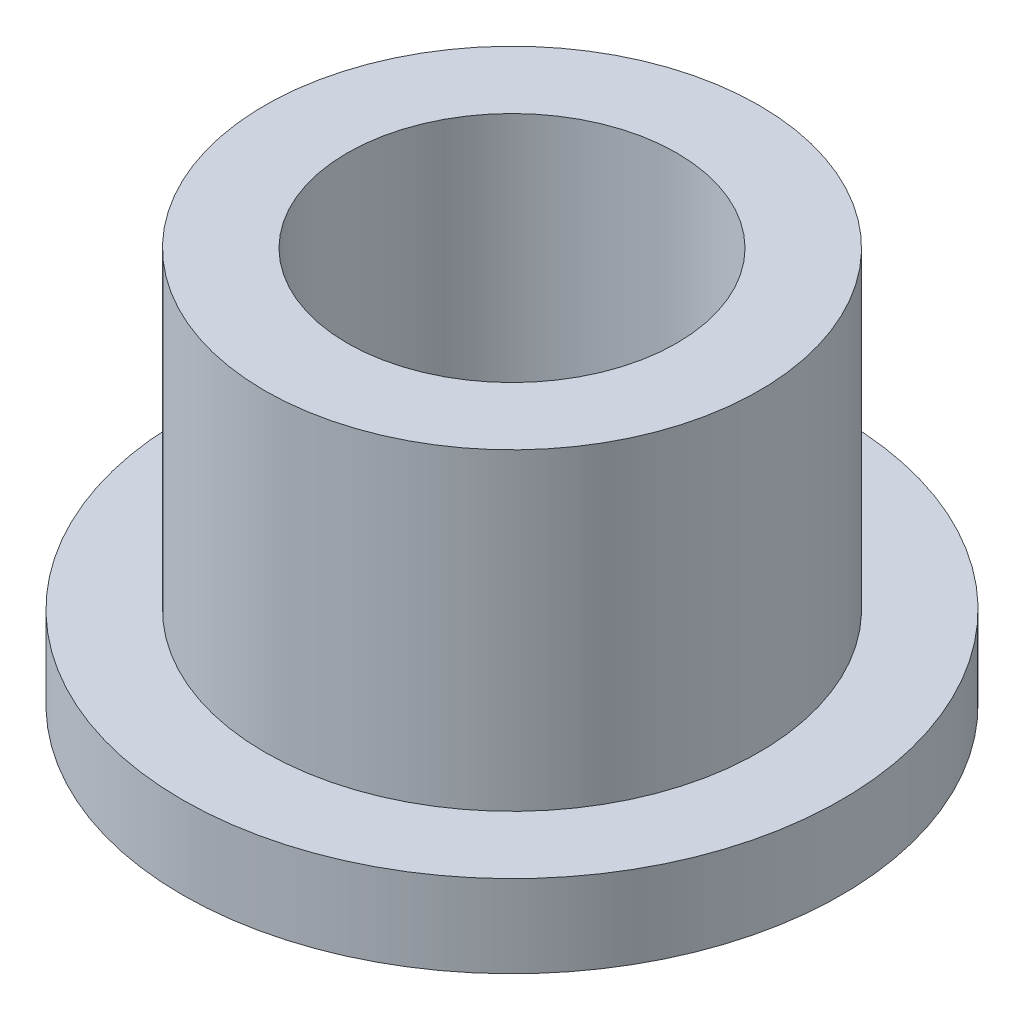
ISO-10303-21;
HEADER;
FILE_DESCRIPTION(('STEP AP214'),'2;1');
FILE_NAME('part.step','',(''),(''),'','','');
FILE_SCHEMA(('AUTOMOTIVE_DESIGN { 1 0 10303 214 1 1 1 1 }'));
ENDSEC;
DATA;
#1=APPLICATION_CONTEXT('core data for automotive mechanical design processes');
#2=APPLICATION_PROTOCOL_DEFINITION('international standard','automotive_design',2000,#1);
#3=PRODUCT_CONTEXT('',#1,'mechanical');
#4=PRODUCT('Part','Part','',(#3));
#5=PRODUCT_RELATED_PRODUCT_CATEGORY('part','',(#4));
#6=PRODUCT_DEFINITION_FORMATION('','',#4);
#7=PRODUCT_DEFINITION_CONTEXT('part definition',#1,'design');
#8=PRODUCT_DEFINITION('design','',#6,#7);
#9=PRODUCT_DEFINITION_SHAPE('','',#8);
#10=(LENGTH_UNIT() NAMED_UNIT(*) SI_UNIT(.MILLI.,.METRE.));
#11=(NAMED_UNIT(*) PLANE_ANGLE_UNIT() SI_UNIT($,.RADIAN.));
#12=(NAMED_UNIT(*) SI_UNIT($,.STERADIAN.) SOLID_ANGLE_UNIT());
#13=UNCERTAINTY_MEASURE_WITH_UNIT(LENGTH_MEASURE(1.E-05),#10,'distance_accuracy_value','');
#14=(GEOMETRIC_REPRESENTATION_CONTEXT(3) GLOBAL_UNCERTAINTY_ASSIGNED_CONTEXT((#13)) GLOBAL_UNIT_ASSIGNED_CONTEXT((#10,
#11,#12)) REPRESENTATION_CONTEXT('',''));
#15=CARTESIAN_POINT('',(0.,0.,0.));
#16=DIRECTION('',(0.,0.,1.));
#17=DIRECTION('',(1.,0.,0.));
#18=AXIS2_PLACEMENT_3D('',#15,#16,#17);
#19=CARTESIAN_POINT('',(0.,7.62,0.));
#20=DIRECTION('',(0.,1.,0.));
#21=DIRECTION('',(0.,0.,1.));
#22=AXIS2_PLACEMENT_3D('',#19,#20,#21);
#23=PLANE('',#22);
#24=CARTESIAN_POINT('',(0.,7.62,0.));
#25=DIRECTION('',(0.,1.,0.));
#26=DIRECTION('',(0.,0.,1.));
#27=AXIS2_PLACEMENT_3D('',#24,#25,#26);
#28=CIRCLE('',#27,4.7625);
#29=CARTESIAN_POINT('',(0.,7.62,4.7625));
#30=VERTEX_POINT('',#29);
#31=EDGE_CURVE('E10',#30,#30,#28,.T.);
#32=ORIENTED_EDGE('',*,*,#31,.T.);
#33=EDGE_LOOP('',(#32));
#34=FACE_BOUND('',#33,.T.);
#35=CARTESIAN_POINT('',(0.,7.62,0.));
#36=DIRECTION('',(0.,1.,0.));
#37=DIRECTION('',(0.,0.,1.));
#38=AXIS2_PLACEMENT_3D('',#35,#36,#37);
#39=CIRCLE('',#38,3.175);
#40=CARTESIAN_POINT('',(0.,7.62,3.175));
#41=VERTEX_POINT('',#40);
#42=EDGE_CURVE('E45',#41,#41,#39,.T.);
#43=ORIENTED_EDGE('',*,*,#42,.F.);
#44=EDGE_LOOP('',(#43));
#45=FACE_BOUND('',#44,.T.);
#46=ADVANCED_FACE('F37',(#34,#45),#23,.T.);
#47=CARTESIAN_POINT('',(0.,0.,0.));
#48=DIRECTION('',(0.,1.,0.));
#49=DIRECTION('',(0.,0.,1.));
#50=AXIS2_PLACEMENT_3D('',#47,#48,#49);
#51=PLANE('',#50);
#52=CARTESIAN_POINT('',(0.,0.,0.));
#53=DIRECTION('',(0.,1.,0.));
#54=DIRECTION('',(0.,0.,1.));
#55=AXIS2_PLACEMENT_3D('',#52,#53,#54);
#56=CIRCLE('',#55,3.175);
#57=CARTESIAN_POINT('',(0.,0.,3.175));
#58=VERTEX_POINT('',#57);
#59=EDGE_CURVE('E50',#58,#58,#56,.T.);
#60=ORIENTED_EDGE('',*,*,#59,.T.);
#61=EDGE_LOOP('',(#60));
#62=FACE_BOUND('',#61,.T.);
#63=CARTESIAN_POINT('',(0.,0.,0.));
#64=DIRECTION('',(0.,1.,0.));
#65=DIRECTION('',(0.,0.,1.));
#66=AXIS2_PLACEMENT_3D('',#63,#64,#65);
#67=CIRCLE('',#66,6.35);
#68=CARTESIAN_POINT('',(0.,0.,6.35));
#69=VERTEX_POINT('',#68);
#70=EDGE_CURVE('E58',#69,#69,#67,.T.);
#71=ORIENTED_EDGE('',*,*,#70,.F.);
#72=EDGE_LOOP('',(#71));
#73=FACE_BOUND('',#72,.T.);
#74=ADVANCED_FACE('F86',(#62,#73),#51,.F.);
#75=CARTESIAN_POINT('',(0.,7.62,0.));
#76=DIRECTION('',(0.,-1.,0.));
#77=DIRECTION('',(0.,0.,-1.));
#78=AXIS2_PLACEMENT_3D('',#75,#76,#77);
#79=CYLINDRICAL_SURFACE('',#78,4.7625);
#80=CARTESIAN_POINT('',(0.,1.5875,0.));
#81=DIRECTION('',(0.,1.,0.));
#82=DIRECTION('',(0.,0.,1.));
#83=AXIS2_PLACEMENT_3D('',#80,#81,#82);
#84=CIRCLE('',#83,4.7625);
#85=CARTESIAN_POINT('',(0.,1.5875,4.7625));
#86=VERTEX_POINT('',#85);
#87=EDGE_CURVE('E62',#86,#86,#84,.T.);
#88=ORIENTED_EDGE('',*,*,#87,.T.);
#89=EDGE_LOOP('',(#88));
#90=FACE_BOUND('',#89,.T.);
#91=ORIENTED_EDGE('',*,*,#31,.F.);
#92=EDGE_LOOP('',(#91));
#93=FACE_BOUND('',#92,.T.);
#94=ADVANCED_FACE('F39',(#90,#93),#79,.T.);
#95=CARTESIAN_POINT('',(0.,7.62,0.));
#96=DIRECTION('',(0.,-1.,0.));
#97=DIRECTION('',(0.,0.,-1.));
#98=AXIS2_PLACEMENT_3D('',#95,#96,#97);
#99=CYLINDRICAL_SURFACE('',#98,3.175);
#100=ORIENTED_EDGE('',*,*,#42,.T.);
#101=EDGE_LOOP('',(#100));
#102=FACE_BOUND('',#101,.T.);
#103=ORIENTED_EDGE('',*,*,#59,.F.);
#104=EDGE_LOOP('',(#103));
#105=FACE_BOUND('',#104,.T.);
#106=ADVANCED_FACE('F75',(#102,#105),#99,.F.);
#107=CARTESIAN_POINT('',(0.,1.5875,0.));
#108=DIRECTION('',(0.,1.,0.));
#109=DIRECTION('',(0.,0.,1.));
#110=AXIS2_PLACEMENT_3D('',#107,#108,#109);
#111=PLANE('',#110);
#112=CARTESIAN_POINT('',(0.,1.5875,0.));
#113=DIRECTION('',(0.,1.,0.));
#114=DIRECTION('',(0.,0.,1.));
#115=AXIS2_PLACEMENT_3D('',#112,#113,#114);
#116=CIRCLE('',#115,6.35);
#117=CARTESIAN_POINT('',(0.,1.5875,6.35));
#118=VERTEX_POINT('',#117);
#119=EDGE_CURVE('E56',#118,#118,#116,.T.);
#120=ORIENTED_EDGE('',*,*,#119,.T.);
#121=EDGE_LOOP('',(#120));
#122=FACE_BOUND('',#121,.T.);
#123=ORIENTED_EDGE('',*,*,#87,.F.);
#124=EDGE_LOOP('',(#123));
#125=FACE_BOUND('',#124,.T.);
#126=ADVANCED_FACE('F72',(#122,#125),#111,.T.);
#127=CARTESIAN_POINT('',(0.,1.5875,0.));
#128=DIRECTION('',(0.,-1.,0.));
#129=DIRECTION('',(0.,0.,-1.));
#130=AXIS2_PLACEMENT_3D('',#127,#128,#129);
#131=CYLINDRICAL_SURFACE('',#130,6.35);
#132=ORIENTED_EDGE('',*,*,#119,.F.);
#133=EDGE_LOOP('',(#132));
#134=FACE_BOUND('',#133,.T.);
#135=ORIENTED_EDGE('',*,*,#70,.T.);
#136=EDGE_LOOP('',(#135));
#137=FACE_BOUND('',#136,.T.);
#138=ADVANCED_FACE('F74',(#134,#137),#131,.T.);
#139=CLOSED_SHELL('',(#46,#74,#94,#106,#126,#138));
#140=MANIFOLD_SOLID_BREP('B2',#139);
#141=ADVANCED_BREP_SHAPE_REPRESENTATION('',(#18,#140),#14);
#142=SHAPE_DEFINITION_REPRESENTATION(#9,#141);
ENDSEC;
END-ISO-10303-21;
